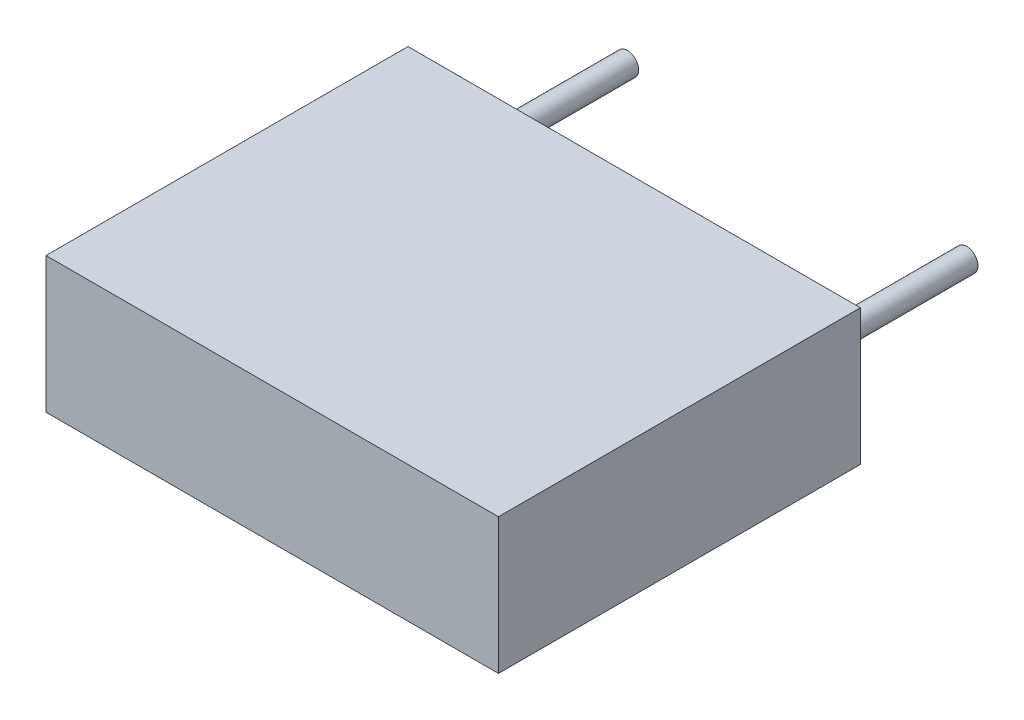
ISO-10303-21;
HEADER;
FILE_DESCRIPTION(('STEP AP214'),'2;1');
FILE_NAME('part.step','',(''),(''),'','','');
FILE_SCHEMA(('AUTOMOTIVE_DESIGN { 1 0 10303 214 1 1 1 1 }'));
ENDSEC;
DATA;
#1=APPLICATION_CONTEXT('core data for automotive mechanical design processes');
#2=APPLICATION_PROTOCOL_DEFINITION('international standard','automotive_design',2000,#1);
#3=PRODUCT_CONTEXT('',#1,'mechanical');
#4=PRODUCT('Part','Part','',(#3));
#5=PRODUCT_RELATED_PRODUCT_CATEGORY('part','',(#4));
#6=PRODUCT_DEFINITION_FORMATION('','',#4);
#7=PRODUCT_DEFINITION_CONTEXT('part definition',#1,'design');
#8=PRODUCT_DEFINITION('design','',#6,#7);
#9=PRODUCT_DEFINITION_SHAPE('','',#8);
#10=(LENGTH_UNIT() NAMED_UNIT(*) SI_UNIT(.MILLI.,.METRE.));
#11=(NAMED_UNIT(*) PLANE_ANGLE_UNIT() SI_UNIT($,.RADIAN.));
#12=(NAMED_UNIT(*) SI_UNIT($,.STERADIAN.) SOLID_ANGLE_UNIT());
#13=UNCERTAINTY_MEASURE_WITH_UNIT(LENGTH_MEASURE(1.E-05),#10,'distance_accuracy_value','');
#14=(GEOMETRIC_REPRESENTATION_CONTEXT(3) GLOBAL_UNCERTAINTY_ASSIGNED_CONTEXT((#13)) GLOBAL_UNIT_ASSIGNED_CONTEXT((#10,
#11,#12)) REPRESENTATION_CONTEXT('',''));
#15=CARTESIAN_POINT('',(0.,0.,0.));
#16=DIRECTION('',(0.,0.,1.));
#17=DIRECTION('',(1.,0.,0.));
#18=AXIS2_PLACEMENT_3D('',#15,#16,#17);
#19=CARTESIAN_POINT('',(5.,-1.5,8.));
#20=DIRECTION('',(-1.,0.,0.));
#21=DIRECTION('',(0.,0.,1.));
#22=AXIS2_PLACEMENT_3D('',#19,#20,#21);
#23=PLANE('',#22);
#24=DIRECTION('',(0.,1.,0.));
#25=VECTOR('',#24,1.);
#26=CARTESIAN_POINT('',(5.,-1.5,0.));
#27=LINE('',#26,#25);
#28=CARTESIAN_POINT('',(5.,-1.5,0.));
#29=VERTEX_POINT('',#28);
#30=CARTESIAN_POINT('',(5.,1.5,0.));
#31=VERTEX_POINT('',#30);
#32=EDGE_CURVE('E109',#29,#31,#27,.T.);
#33=ORIENTED_EDGE('',*,*,#32,.T.);
#34=DIRECTION('',(0.,0.,-1.));
#35=VECTOR('',#34,1.);
#36=CARTESIAN_POINT('',(5.,1.5,8.));
#37=LINE('',#36,#35);
#38=CARTESIAN_POINT('',(5.,1.5,8.));
#39=VERTEX_POINT('',#38);
#40=EDGE_CURVE('E11',#39,#31,#37,.T.);
#41=ORIENTED_EDGE('',*,*,#40,.F.);
#42=DIRECTION('',(0.,1.,0.));
#43=VECTOR('',#42,1.);
#44=CARTESIAN_POINT('',(5.,-1.5,8.));
#45=LINE('',#44,#43);
#46=CARTESIAN_POINT('',(5.,-1.5,8.));
#47=VERTEX_POINT('',#46);
#48=EDGE_CURVE('E93',#47,#39,#45,.T.);
#49=ORIENTED_EDGE('',*,*,#48,.F.);
#50=DIRECTION('',(0.,0.,-1.));
#51=VECTOR('',#50,1.);
#52=CARTESIAN_POINT('',(5.,-1.5,8.));
#53=LINE('',#52,#51);
#54=EDGE_CURVE('E105',#47,#29,#53,.T.);
#55=ORIENTED_EDGE('',*,*,#54,.T.);
#56=EDGE_LOOP('',(#33,#41,#49,#55));
#57=FACE_BOUND('',#56,.T.);
#58=ADVANCED_FACE('F41',(#57),#23,.F.);
#59=CARTESIAN_POINT('',(-5.,1.5,8.));
#60=DIRECTION('',(0.,-1.,0.));
#61=DIRECTION('',(0.,0.,-1.));
#62=AXIS2_PLACEMENT_3D('',#59,#60,#61);
#63=PLANE('',#62);
#64=DIRECTION('',(-1.,0.,0.));
#65=VECTOR('',#64,1.);
#66=CARTESIAN_POINT('',(-5.,1.5,0.));
#67=LINE('',#66,#65);
#68=CARTESIAN_POINT('',(-5.,1.5,0.));
#69=VERTEX_POINT('',#68);
#70=EDGE_CURVE('E98',#31,#69,#67,.T.);
#71=ORIENTED_EDGE('',*,*,#70,.T.);
#72=DIRECTION('',(0.,0.,-1.));
#73=VECTOR('',#72,1.);
#74=CARTESIAN_POINT('',(-5.,1.5,8.));
#75=LINE('',#74,#73);
#76=CARTESIAN_POINT('',(-5.,1.5,8.));
#77=VERTEX_POINT('',#76);
#78=EDGE_CURVE('E50',#77,#69,#75,.T.);
#79=ORIENTED_EDGE('',*,*,#78,.F.);
#80=DIRECTION('',(-1.,0.,0.));
#81=VECTOR('',#80,1.);
#82=CARTESIAN_POINT('',(-5.,1.5,8.));
#83=LINE('',#82,#81);
#84=EDGE_CURVE('E88',#39,#77,#83,.T.);
#85=ORIENTED_EDGE('',*,*,#84,.F.);
#86=ORIENTED_EDGE('',*,*,#40,.T.);
#87=EDGE_LOOP('',(#71,#79,#85,#86));
#88=FACE_BOUND('',#87,.T.);
#89=ADVANCED_FACE('F97',(#88),#63,.F.);
#90=CARTESIAN_POINT('',(-5.,-1.5,8.));
#91=DIRECTION('',(1.,0.,0.));
#92=DIRECTION('',(0.,0.,-1.));
#93=AXIS2_PLACEMENT_3D('',#90,#91,#92);
#94=PLANE('',#93);
#95=DIRECTION('',(0.,-1.,0.));
#96=VECTOR('',#95,1.);
#97=CARTESIAN_POINT('',(-5.,-1.5,0.));
#98=LINE('',#97,#96);
#99=CARTESIAN_POINT('',(-5.,-1.5,0.));
#100=VERTEX_POINT('',#99);
#101=EDGE_CURVE('E75',#69,#100,#98,.T.);
#102=ORIENTED_EDGE('',*,*,#101,.T.);
#103=DIRECTION('',(0.,0.,-1.));
#104=VECTOR('',#103,1.);
#105=CARTESIAN_POINT('',(-5.,-1.5,8.));
#106=LINE('',#105,#104);
#107=CARTESIAN_POINT('',(-5.,-1.5,8.));
#108=VERTEX_POINT('',#107);
#109=EDGE_CURVE('E100',#108,#100,#106,.T.);
#110=ORIENTED_EDGE('',*,*,#109,.F.);
#111=DIRECTION('',(0.,-1.,0.));
#112=VECTOR('',#111,1.);
#113=CARTESIAN_POINT('',(-5.,-1.5,8.));
#114=LINE('',#113,#112);
#115=EDGE_CURVE('E91',#77,#108,#114,.T.);
#116=ORIENTED_EDGE('',*,*,#115,.F.);
#117=ORIENTED_EDGE('',*,*,#78,.T.);
#118=EDGE_LOOP('',(#102,#110,#116,#117));
#119=FACE_BOUND('',#118,.T.);
#120=ADVANCED_FACE('F101',(#119),#94,.F.);
#121=CARTESIAN_POINT('',(-5.,-1.5,8.));
#122=DIRECTION('',(0.,1.,0.));
#123=DIRECTION('',(0.,0.,1.));
#124=AXIS2_PLACEMENT_3D('',#121,#122,#123);
#125=PLANE('',#124);
#126=DIRECTION('',(1.,0.,0.));
#127=VECTOR('',#126,1.);
#128=CARTESIAN_POINT('',(-5.,-1.5,0.));
#129=LINE('',#128,#127);
#130=EDGE_CURVE('E81',#100,#29,#129,.T.);
#131=ORIENTED_EDGE('',*,*,#130,.T.);
#132=ORIENTED_EDGE('',*,*,#54,.F.);
#133=DIRECTION('',(1.,0.,0.));
#134=VECTOR('',#133,1.);
#135=CARTESIAN_POINT('',(-5.,-1.5,8.));
#136=LINE('',#135,#134);
#137=EDGE_CURVE('E58',#108,#47,#136,.T.);
#138=ORIENTED_EDGE('',*,*,#137,.F.);
#139=ORIENTED_EDGE('',*,*,#109,.T.);
#140=EDGE_LOOP('',(#131,#132,#138,#139));
#141=FACE_BOUND('',#140,.T.);
#142=ADVANCED_FACE('F123',(#141),#125,.F.);
#143=CARTESIAN_POINT('',(0.,0.,8.));
#144=DIRECTION('',(0.,0.,-1.));
#145=DIRECTION('',(-1.,0.,0.));
#146=AXIS2_PLACEMENT_3D('',#143,#144,#145);
#147=PLANE('',#146);
#148=ORIENTED_EDGE('',*,*,#48,.T.);
#149=ORIENTED_EDGE('',*,*,#84,.T.);
#150=ORIENTED_EDGE('',*,*,#115,.T.);
#151=ORIENTED_EDGE('',*,*,#137,.T.);
#152=EDGE_LOOP('',(#148,#149,#150,#151));
#153=FACE_BOUND('',#152,.T.);
#154=ADVANCED_FACE('F89',(#153),#147,.F.);
#155=CARTESIAN_POINT('',(0.,0.,0.));
#156=DIRECTION('',(0.,0.,-1.));
#157=DIRECTION('',(-1.,0.,0.));
#158=AXIS2_PLACEMENT_3D('',#155,#156,#157);
#159=PLANE('',#158);
#160=CARTESIAN_POINT('',(-3.75,0.,0.));
#161=DIRECTION('',(0.,0.,-1.));
#162=DIRECTION('',(-1.,0.,0.));
#163=AXIS2_PLACEMENT_3D('',#160,#161,#162);
#164=CIRCLE('',#163,0.25);
#165=CARTESIAN_POINT('',(-4.,0.,0.));
#166=VERTEX_POINT('',#165);
#167=EDGE_CURVE('E138',#166,#166,#164,.T.);
#168=ORIENTED_EDGE('',*,*,#167,.F.);
#169=EDGE_LOOP('',(#168));
#170=FACE_BOUND('',#169,.T.);
#171=CARTESIAN_POINT('',(3.75,0.,0.));
#172=DIRECTION('',(0.,0.,-1.));
#173=DIRECTION('',(-1.,0.,0.));
#174=AXIS2_PLACEMENT_3D('',#171,#172,#173);
#175=CIRCLE('',#174,0.25);
#176=CARTESIAN_POINT('',(3.5,0.,0.));
#177=VERTEX_POINT('',#176);
#178=EDGE_CURVE('E130',#177,#177,#175,.T.);
#179=ORIENTED_EDGE('',*,*,#178,.F.);
#180=EDGE_LOOP('',(#179));
#181=FACE_BOUND('',#180,.T.);
#182=ORIENTED_EDGE('',*,*,#32,.F.);
#183=ORIENTED_EDGE('',*,*,#130,.F.);
#184=ORIENTED_EDGE('',*,*,#101,.F.);
#185=ORIENTED_EDGE('',*,*,#70,.F.);
#186=EDGE_LOOP('',(#182,#183,#184,#185));
#187=FACE_BOUND('',#186,.T.);
#188=ADVANCED_FACE('F126',(#170,#181,#187),#159,.T.);
#189=CARTESIAN_POINT('',(3.75,0.,-3.6));
#190=DIRECTION('',(0.,0.,1.));
#191=DIRECTION('',(1.,0.,0.));
#192=AXIS2_PLACEMENT_3D('',#189,#190,#191);
#193=CYLINDRICAL_SURFACE('',#192,0.25);
#194=CARTESIAN_POINT('',(3.75,0.,-3.6));
#195=DIRECTION('',(0.,0.,-1.));
#196=DIRECTION('',(-1.,0.,0.));
#197=AXIS2_PLACEMENT_3D('',#194,#195,#196);
#198=CIRCLE('',#197,0.25);
#199=CARTESIAN_POINT('',(3.5,0.,-3.6));
#200=VERTEX_POINT('',#199);
#201=EDGE_CURVE('E113',#200,#200,#198,.T.);
#202=ORIENTED_EDGE('',*,*,#201,.F.);
#203=EDGE_LOOP('',(#202));
#204=FACE_BOUND('',#203,.T.);
#205=ORIENTED_EDGE('',*,*,#178,.T.);
#206=EDGE_LOOP('',(#205));
#207=FACE_BOUND('',#206,.T.);
#208=ADVANCED_FACE('F157',(#204,#207),#193,.T.);
#209=CARTESIAN_POINT('',(3.75,0.,-3.6));
#210=DIRECTION('',(0.,0.,-1.));
#211=DIRECTION('',(-1.,0.,0.));
#212=AXIS2_PLACEMENT_3D('',#209,#210,#211);
#213=PLANE('',#212);
#214=ORIENTED_EDGE('',*,*,#201,.T.);
#215=EDGE_LOOP('',(#214));
#216=FACE_BOUND('',#215,.T.);
#217=ADVANCED_FACE('F151',(#216),#213,.T.);
#218=CARTESIAN_POINT('',(-3.75,0.,-3.6));
#219=DIRECTION('',(0.,0.,1.));
#220=DIRECTION('',(1.,0.,0.));
#221=AXIS2_PLACEMENT_3D('',#218,#219,#220);
#222=CYLINDRICAL_SURFACE('',#221,0.25);
#223=CARTESIAN_POINT('',(-3.75,0.,-3.6));
#224=DIRECTION('',(0.,0.,-1.));
#225=DIRECTION('',(-1.,0.,0.));
#226=AXIS2_PLACEMENT_3D('',#223,#224,#225);
#227=CIRCLE('',#226,0.25);
#228=CARTESIAN_POINT('',(-4.,0.,-3.6));
#229=VERTEX_POINT('',#228);
#230=EDGE_CURVE('E134',#229,#229,#227,.T.);
#231=ORIENTED_EDGE('',*,*,#230,.F.);
#232=EDGE_LOOP('',(#231));
#233=FACE_BOUND('',#232,.T.);
#234=ORIENTED_EDGE('',*,*,#167,.T.);
#235=EDGE_LOOP('',(#234));
#236=FACE_BOUND('',#235,.T.);
#237=ADVANCED_FACE('F148',(#233,#236),#222,.T.);
#238=CARTESIAN_POINT('',(-3.75,0.,-3.6));
#239=DIRECTION('',(0.,0.,-1.));
#240=DIRECTION('',(-1.,0.,0.));
#241=AXIS2_PLACEMENT_3D('',#238,#239,#240);
#242=PLANE('',#241);
#243=ORIENTED_EDGE('',*,*,#230,.T.);
#244=EDGE_LOOP('',(#243));
#245=FACE_BOUND('',#244,.T.);
#246=ADVANCED_FACE('F146',(#245),#242,.T.);
#247=CLOSED_SHELL('',(#58,#89,#120,#142,#154,#188,#208,#217,#237,#246));
#248=MANIFOLD_SOLID_BREP('B2',#247);
#249=ADVANCED_BREP_SHAPE_REPRESENTATION('',(#18,#248),#14);
#250=SHAPE_DEFINITION_REPRESENTATION(#9,#249);
ENDSEC;
END-ISO-10303-21;
